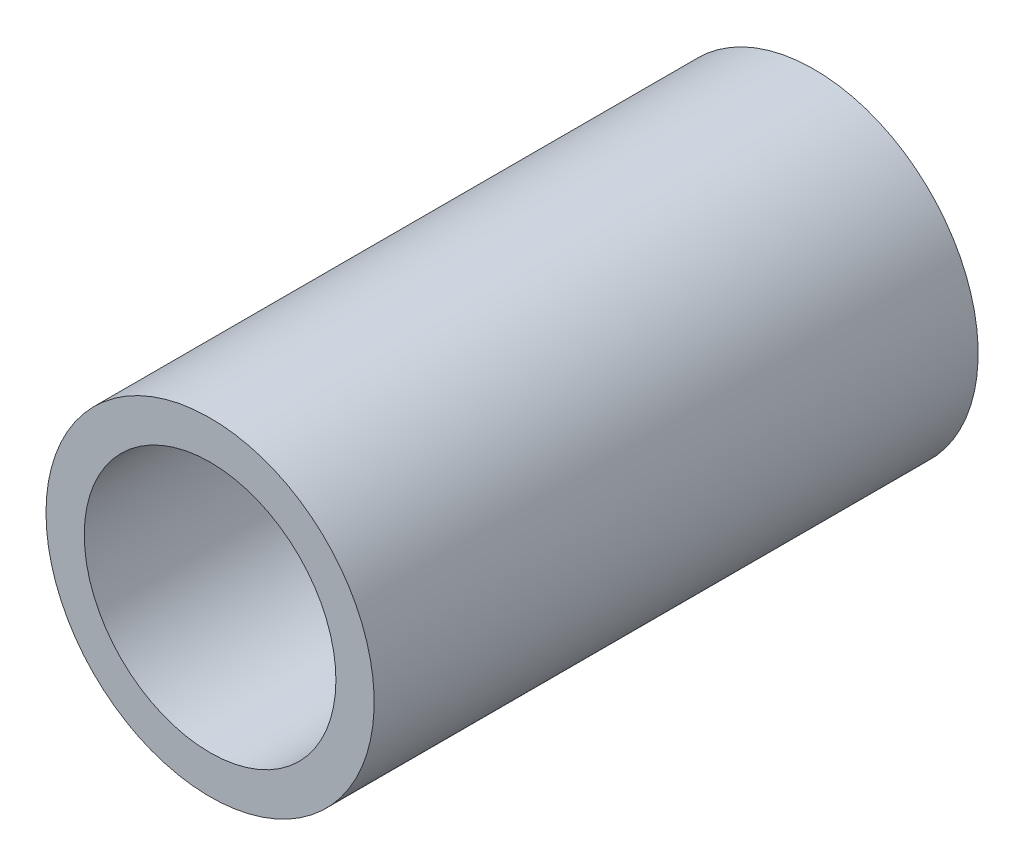
ISO-10303-21;
HEADER;
FILE_DESCRIPTION(('STEP AP214'),'2;1');
FILE_NAME('part.step','',(''),(''),'','','');
FILE_SCHEMA(('AUTOMOTIVE_DESIGN { 1 0 10303 214 1 1 1 1 }'));
ENDSEC;
DATA;
#1=APPLICATION_CONTEXT('core data for automotive mechanical design processes');
#2=APPLICATION_PROTOCOL_DEFINITION('international standard','automotive_design',2000,#1);
#3=PRODUCT_CONTEXT('',#1,'mechanical');
#4=PRODUCT('Part','Part','',(#3));
#5=PRODUCT_RELATED_PRODUCT_CATEGORY('part','',(#4));
#6=PRODUCT_DEFINITION_FORMATION('','',#4);
#7=PRODUCT_DEFINITION_CONTEXT('part definition',#1,'design');
#8=PRODUCT_DEFINITION('design','',#6,#7);
#9=PRODUCT_DEFINITION_SHAPE('','',#8);
#10=(LENGTH_UNIT() NAMED_UNIT(*) SI_UNIT(.MILLI.,.METRE.));
#11=(NAMED_UNIT(*) PLANE_ANGLE_UNIT() SI_UNIT($,.RADIAN.));
#12=(NAMED_UNIT(*) SI_UNIT($,.STERADIAN.) SOLID_ANGLE_UNIT());
#13=UNCERTAINTY_MEASURE_WITH_UNIT(LENGTH_MEASURE(1.E-05),#10,'distance_accuracy_value','');
#14=(GEOMETRIC_REPRESENTATION_CONTEXT(3) GLOBAL_UNCERTAINTY_ASSIGNED_CONTEXT((#13)) GLOBAL_UNIT_ASSIGNED_CONTEXT((#10,
#11,#12)) REPRESENTATION_CONTEXT('',''));
#15=CARTESIAN_POINT('',(0.,0.,0.));
#16=DIRECTION('',(0.,0.,1.));
#17=DIRECTION('',(1.,0.,0.));
#18=AXIS2_PLACEMENT_3D('',#15,#16,#17);
#19=CARTESIAN_POINT('',(0.,0.,19.05));
#20=DIRECTION('',(0.,0.,1.));
#21=DIRECTION('',(1.,0.,0.));
#22=AXIS2_PLACEMENT_3D('',#19,#20,#21);
#23=PLANE('',#22);
#24=CARTESIAN_POINT('',(0.,0.,19.05));
#25=DIRECTION('',(0.,0.,1.));
#26=DIRECTION('',(1.,0.,0.));
#27=AXIS2_PLACEMENT_3D('',#24,#25,#26);
#28=CIRCLE('',#27,10.3505);
#29=CARTESIAN_POINT('',(-10.3505,0.,19.05));
#30=VERTEX_POINT('',#29);
#31=EDGE_CURVE('E10',#30,#30,#28,.T.);
#32=ORIENTED_EDGE('',*,*,#31,.T.);
#33=EDGE_LOOP('',(#32));
#34=FACE_BOUND('',#33,.T.);
#35=CARTESIAN_POINT('',(0.,0.,19.05));
#36=DIRECTION('',(0.,0.,1.));
#37=DIRECTION('',(1.,0.,0.));
#38=AXIS2_PLACEMENT_3D('',#35,#36,#37);
#39=CIRCLE('',#38,7.9375);
#40=CARTESIAN_POINT('',(-7.9375,0.,19.05));
#41=VERTEX_POINT('',#40);
#42=EDGE_CURVE('E54',#41,#41,#39,.T.);
#43=ORIENTED_EDGE('',*,*,#42,.F.);
#44=EDGE_LOOP('',(#43));
#45=FACE_BOUND('',#44,.T.);
#46=ADVANCED_FACE('F41',(#34,#45),#23,.T.);
#47=CARTESIAN_POINT('',(0.,0.,-19.05));
#48=DIRECTION('',(0.,0.,1.));
#49=DIRECTION('',(1.,0.,0.));
#50=AXIS2_PLACEMENT_3D('',#47,#48,#49);
#51=PLANE('',#50);
#52=CARTESIAN_POINT('',(0.,0.,-19.05));
#53=DIRECTION('',(0.,0.,1.));
#54=DIRECTION('',(1.,0.,0.));
#55=AXIS2_PLACEMENT_3D('',#52,#53,#54);
#56=CIRCLE('',#55,10.3505);
#57=CARTESIAN_POINT('',(-10.3505,0.,-19.05));
#58=VERTEX_POINT('',#57);
#59=EDGE_CURVE('E45',#58,#58,#56,.T.);
#60=ORIENTED_EDGE('',*,*,#59,.F.);
#61=EDGE_LOOP('',(#60));
#62=FACE_BOUND('',#61,.T.);
#63=CARTESIAN_POINT('',(0.,0.,-19.05));
#64=DIRECTION('',(0.,0.,1.));
#65=DIRECTION('',(1.,0.,0.));
#66=AXIS2_PLACEMENT_3D('',#63,#64,#65);
#67=CIRCLE('',#66,7.9375);
#68=CARTESIAN_POINT('',(-7.9375,0.,-19.05));
#69=VERTEX_POINT('',#68);
#70=EDGE_CURVE('E56',#69,#69,#67,.T.);
#71=ORIENTED_EDGE('',*,*,#70,.T.);
#72=EDGE_LOOP('',(#71));
#73=FACE_BOUND('',#72,.T.);
#74=ADVANCED_FACE('F68',(#62,#73),#51,.F.);
#75=CARTESIAN_POINT('',(0.,0.,19.05));
#76=DIRECTION('',(0.,0.,-1.));
#77=DIRECTION('',(-1.,0.,0.));
#78=AXIS2_PLACEMENT_3D('',#75,#76,#77);
#79=CYLINDRICAL_SURFACE('',#78,10.3505);
#80=CARTESIAN_POINT('',(-10.3505,0.,19.05));
#81=CARTESIAN_POINT('',(-10.3505,0.,18.653125));
#82=CARTESIAN_POINT('',(-10.3505,0.,18.25625));
#83=CARTESIAN_POINT('',(-10.3505,0.,17.4625));
#84=CARTESIAN_POINT('',(-10.3505,0.,17.065625));
#85=CARTESIAN_POINT('',(-10.3505,0.,16.271875));
#86=CARTESIAN_POINT('',(-10.3505,0.,15.875));
#87=CARTESIAN_POINT('',(-10.3505,0.,15.08125));
#88=CARTESIAN_POINT('',(-10.3505,0.,14.684375));
#89=CARTESIAN_POINT('',(-10.3505,0.,13.890625));
#90=CARTESIAN_POINT('',(-10.3505,0.,13.49375));
#91=CARTESIAN_POINT('',(-10.3505,0.,12.7));
#92=CARTESIAN_POINT('',(-10.3505,0.,12.303125));
#93=CARTESIAN_POINT('',(-10.3505,0.,11.509375));
#94=CARTESIAN_POINT('',(-10.3505,0.,11.1125));
#95=CARTESIAN_POINT('',(-10.3505,0.,10.31875));
#96=CARTESIAN_POINT('',(-10.3505,0.,9.921875));
#97=CARTESIAN_POINT('',(-10.3505,0.,9.128125));
#98=CARTESIAN_POINT('',(-10.3505,0.,8.73125));
#99=CARTESIAN_POINT('',(-10.3505,0.,7.9375));
#100=CARTESIAN_POINT('',(-10.3505,0.,7.540625));
#101=CARTESIAN_POINT('',(-10.3505,0.,6.746875));
#102=CARTESIAN_POINT('',(-10.3505,0.,6.35));
#103=CARTESIAN_POINT('',(-10.3505,0.,5.55625));
#104=CARTESIAN_POINT('',(-10.3505,0.,5.159375));
#105=CARTESIAN_POINT('',(-10.3505,0.,4.365625));
#106=CARTESIAN_POINT('',(-10.3505,0.,3.96875));
#107=CARTESIAN_POINT('',(-10.3505,0.,3.175));
#108=CARTESIAN_POINT('',(-10.3505,0.,2.778125));
#109=CARTESIAN_POINT('',(-10.3505,0.,1.984375));
#110=CARTESIAN_POINT('',(-10.3505,0.,1.5875));
#111=CARTESIAN_POINT('',(-10.3505,0.,0.793749999999997));
#112=CARTESIAN_POINT('',(-10.3505,0.,0.396874999999997));
#113=CARTESIAN_POINT('',(-10.3505,0.,-0.396875000000004));
#114=CARTESIAN_POINT('',(-10.3505,0.,-0.793750000000004));
#115=CARTESIAN_POINT('',(-10.3505,0.,-1.5875));
#116=CARTESIAN_POINT('',(-10.3505,0.,-1.984375));
#117=CARTESIAN_POINT('',(-10.3505,0.,-2.77812500000001));
#118=CARTESIAN_POINT('',(-10.3505,0.,-3.17500000000001));
#119=CARTESIAN_POINT('',(-10.3505,0.,-3.96875000000001));
#120=CARTESIAN_POINT('',(-10.3505,0.,-4.36562500000001));
#121=CARTESIAN_POINT('',(-10.3505,0.,-5.15937500000001));
#122=CARTESIAN_POINT('',(-10.3505,0.,-5.55625));
#123=CARTESIAN_POINT('',(-10.3505,0.,-6.35));
#124=CARTESIAN_POINT('',(-10.3505,0.,-6.746875));
#125=CARTESIAN_POINT('',(-10.3505,0.,-7.540625));
#126=CARTESIAN_POINT('',(-10.3505,0.,-7.93750000000001));
#127=CARTESIAN_POINT('',(-10.3505,0.,-8.73125));
#128=CARTESIAN_POINT('',(-10.3505,0.,-9.12812500000001));
#129=CARTESIAN_POINT('',(-10.3505,0.,-9.92187500000001));
#130=CARTESIAN_POINT('',(-10.3505,0.,-10.31875));
#131=CARTESIAN_POINT('',(-10.3505,0.,-11.1125));
#132=CARTESIAN_POINT('',(-10.3505,0.,-11.509375));
#133=CARTESIAN_POINT('',(-10.3505,0.,-12.303125));
#134=CARTESIAN_POINT('',(-10.3505,0.,-12.7));
#135=CARTESIAN_POINT('',(-10.3505,0.,-13.49375));
#136=CARTESIAN_POINT('',(-10.3505,0.,-13.890625));
#137=CARTESIAN_POINT('',(-10.3505,0.,-14.684375));
#138=CARTESIAN_POINT('',(-10.3505,0.,-15.08125));
#139=CARTESIAN_POINT('',(-10.3505,0.,-15.875));
#140=CARTESIAN_POINT('',(-10.3505,0.,-16.271875));
#141=CARTESIAN_POINT('',(-10.3505,0.,-17.065625));
#142=CARTESIAN_POINT('',(-10.3505,0.,-17.4625));
#143=CARTESIAN_POINT('',(-10.3505,0.,-18.25625));
#144=CARTESIAN_POINT('',(-10.3505,0.,-18.653125));
#145=CARTESIAN_POINT('',(-10.3505,0.,-19.05));
#146=B_SPLINE_CURVE_WITH_KNOTS('',3,(#80,#81,#82,#83,#84,#85,#86,#87,#88,#89,#90,#91,#92,#93,
#94,#95,#96,#97,#98,#99,#100,#101,#102,#103,#104,#105,#106,#107,#108,#109,#110,#111,#112,#113,
#114,#115,#116,#117,#118,#119,#120,#121,#122,#123,#124,#125,#126,#127,#128,#129,#130,#131,#132,
#133,#134,#135,#136,#137,#138,#139,#140,#141,#142,#143,#144,#145),.UNSPECIFIED.,.F.,.F.,(4,2,2,
2,2,2,2,2,2,2,2,2,2,2,2,2,2,2,2,2,2,2,2,2,2,2,2,2,2,2,2,2,4),(0.,1.190625,2.38125,3.571875,
4.7625,5.953125,7.14375,8.334375,9.525,10.715625,11.90625,13.096875,14.2875,15.478125,16.66875,
17.859375,19.05,20.240625,21.43125,22.621875,23.8125,25.003125,26.19375,27.384375,28.575,
29.765625,30.95625,32.146875,33.3375,34.528125,35.71875,36.909375,38.1),.UNSPECIFIED.);
#147=EDGE_CURVE('BSEAM43',#30,#58,#146,.T.);
#148=ORIENTED_EDGE('',*,*,#31,.F.);
#149=ORIENTED_EDGE('',*,*,#59,.T.);
#150=ORIENTED_EDGE('',*,*,#147,.T.);
#151=ORIENTED_EDGE('',*,*,#147,.F.);
#152=EDGE_LOOP('',(#148,#150,#149,#151));
#153=FACE_BOUND('',#152,.T.);
#154=ADVANCED_FACE('F43',(#153),#79,.T.);
#155=CARTESIAN_POINT('',(0.,0.,19.05));
#156=DIRECTION('',(0.,0.,-1.));
#157=DIRECTION('',(-1.,0.,0.));
#158=AXIS2_PLACEMENT_3D('',#155,#156,#157);
#159=CYLINDRICAL_SURFACE('',#158,7.9375);
#160=CARTESIAN_POINT('',(-7.9375,0.,19.05));
#161=CARTESIAN_POINT('',(-7.9375,0.,18.653125));
#162=CARTESIAN_POINT('',(-7.9375,0.,18.25625));
#163=CARTESIAN_POINT('',(-7.9375,0.,17.4625));
#164=CARTESIAN_POINT('',(-7.9375,0.,17.065625));
#165=CARTESIAN_POINT('',(-7.9375,0.,16.271875));
#166=CARTESIAN_POINT('',(-7.9375,0.,15.875));
#167=CARTESIAN_POINT('',(-7.9375,0.,15.08125));
#168=CARTESIAN_POINT('',(-7.9375,0.,14.684375));
#169=CARTESIAN_POINT('',(-7.9375,0.,13.890625));
#170=CARTESIAN_POINT('',(-7.9375,0.,13.49375));
#171=CARTESIAN_POINT('',(-7.9375,0.,12.7));
#172=CARTESIAN_POINT('',(-7.9375,0.,12.303125));
#173=CARTESIAN_POINT('',(-7.9375,0.,11.509375));
#174=CARTESIAN_POINT('',(-7.9375,0.,11.1125));
#175=CARTESIAN_POINT('',(-7.9375,0.,10.31875));
#176=CARTESIAN_POINT('',(-7.9375,0.,9.921875));
#177=CARTESIAN_POINT('',(-7.9375,0.,9.128125));
#178=CARTESIAN_POINT('',(-7.9375,0.,8.73125));
#179=CARTESIAN_POINT('',(-7.9375,0.,7.9375));
#180=CARTESIAN_POINT('',(-7.9375,0.,7.540625));
#181=CARTESIAN_POINT('',(-7.9375,0.,6.746875));
#182=CARTESIAN_POINT('',(-7.9375,0.,6.35));
#183=CARTESIAN_POINT('',(-7.9375,0.,5.55625));
#184=CARTESIAN_POINT('',(-7.9375,0.,5.159375));
#185=CARTESIAN_POINT('',(-7.9375,0.,4.365625));
#186=CARTESIAN_POINT('',(-7.9375,0.,3.96875));
#187=CARTESIAN_POINT('',(-7.9375,0.,3.175));
#188=CARTESIAN_POINT('',(-7.9375,0.,2.778125));
#189=CARTESIAN_POINT('',(-7.9375,0.,1.984375));
#190=CARTESIAN_POINT('',(-7.9375,0.,1.5875));
#191=CARTESIAN_POINT('',(-7.9375,0.,0.79375));
#192=CARTESIAN_POINT('',(-7.9375,0.,0.396875));
#193=CARTESIAN_POINT('',(-7.9375,0.,-0.396875));
#194=CARTESIAN_POINT('',(-7.9375,0.,-0.79375));
#195=CARTESIAN_POINT('',(-7.9375,0.,-1.5875));
#196=CARTESIAN_POINT('',(-7.9375,0.,-1.984375));
#197=CARTESIAN_POINT('',(-7.9375,0.,-2.778125));
#198=CARTESIAN_POINT('',(-7.9375,0.,-3.175));
#199=CARTESIAN_POINT('',(-7.9375,0.,-3.96875));
#200=CARTESIAN_POINT('',(-7.9375,0.,-4.365625));
#201=CARTESIAN_POINT('',(-7.9375,0.,-5.159375));
#202=CARTESIAN_POINT('',(-7.9375,0.,-5.55625));
#203=CARTESIAN_POINT('',(-7.9375,0.,-6.35));
#204=CARTESIAN_POINT('',(-7.9375,0.,-6.746875));
#205=CARTESIAN_POINT('',(-7.9375,0.,-7.540625));
#206=CARTESIAN_POINT('',(-7.9375,0.,-7.9375));
#207=CARTESIAN_POINT('',(-7.9375,0.,-8.73125));
#208=CARTESIAN_POINT('',(-7.9375,0.,-9.128125));
#209=CARTESIAN_POINT('',(-7.9375,0.,-9.921875));
#210=CARTESIAN_POINT('',(-7.9375,0.,-10.31875));
#211=CARTESIAN_POINT('',(-7.9375,0.,-11.1125));
#212=CARTESIAN_POINT('',(-7.9375,0.,-11.509375));
#213=CARTESIAN_POINT('',(-7.9375,0.,-12.303125));
#214=CARTESIAN_POINT('',(-7.9375,0.,-12.7));
#215=CARTESIAN_POINT('',(-7.9375,0.,-13.49375));
#216=CARTESIAN_POINT('',(-7.9375,0.,-13.890625));
#217=CARTESIAN_POINT('',(-7.9375,0.,-14.684375));
#218=CARTESIAN_POINT('',(-7.9375,0.,-15.08125));
#219=CARTESIAN_POINT('',(-7.9375,0.,-15.875));
#220=CARTESIAN_POINT('',(-7.9375,0.,-16.271875));
#221=CARTESIAN_POINT('',(-7.9375,0.,-17.065625));
#222=CARTESIAN_POINT('',(-7.9375,0.,-17.4625));
#223=CARTESIAN_POINT('',(-7.9375,0.,-18.25625));
#224=CARTESIAN_POINT('',(-7.9375,0.,-18.653125));
#225=CARTESIAN_POINT('',(-7.9375,0.,-19.05));
#226=B_SPLINE_CURVE_WITH_KNOTS('',3,(#160,#161,#162,#163,#164,#165,#166,#167,#168,#169,#170,
#171,#172,#173,#174,#175,#176,#177,#178,#179,#180,#181,#182,#183,#184,#185,#186,#187,#188,#189,
#190,#191,#192,#193,#194,#195,#196,#197,#198,#199,#200,#201,#202,#203,#204,#205,#206,#207,#208,
#209,#210,#211,#212,#213,#214,#215,#216,#217,#218,#219,#220,#221,#222,#223,#224,#225),
.UNSPECIFIED.,.F.,.F.,(4,2,2,2,2,2,2,2,2,2,2,2,2,2,2,2,2,2,2,2,2,2,2,2,2,2,2,2,2,2,2,2,4),(0.,
1.190625,2.38125,3.571875,4.7625,5.953125,7.14375,8.334375,9.525,10.715625,11.90625,13.096875,
14.2875,15.478125,16.66875,17.859375,19.05,20.240625,21.43125,22.621875,23.8125,25.003125,
26.19375,27.384375,28.575,29.765625,30.95625,32.146875,33.3375,34.528125,35.71875,36.909375,
38.1),.UNSPECIFIED.);
#227=EDGE_CURVE('BSEAM64',#41,#69,#226,.T.);
#228=ORIENTED_EDGE('',*,*,#42,.T.);
#229=ORIENTED_EDGE('',*,*,#70,.F.);
#230=ORIENTED_EDGE('',*,*,#227,.T.);
#231=ORIENTED_EDGE('',*,*,#227,.F.);
#232=EDGE_LOOP('',(#228,#230,#229,#231));
#233=FACE_BOUND('',#232,.T.);
#234=ADVANCED_FACE('F64',(#233),#159,.F.);
#235=CLOSED_SHELL('',(#46,#74,#154,#234));
#236=MANIFOLD_SOLID_BREP('B2',#235);
#237=ADVANCED_BREP_SHAPE_REPRESENTATION('',(#18,#236),#14);
#238=SHAPE_DEFINITION_REPRESENTATION(#9,#237);
ENDSEC;
END-ISO-10303-21;
